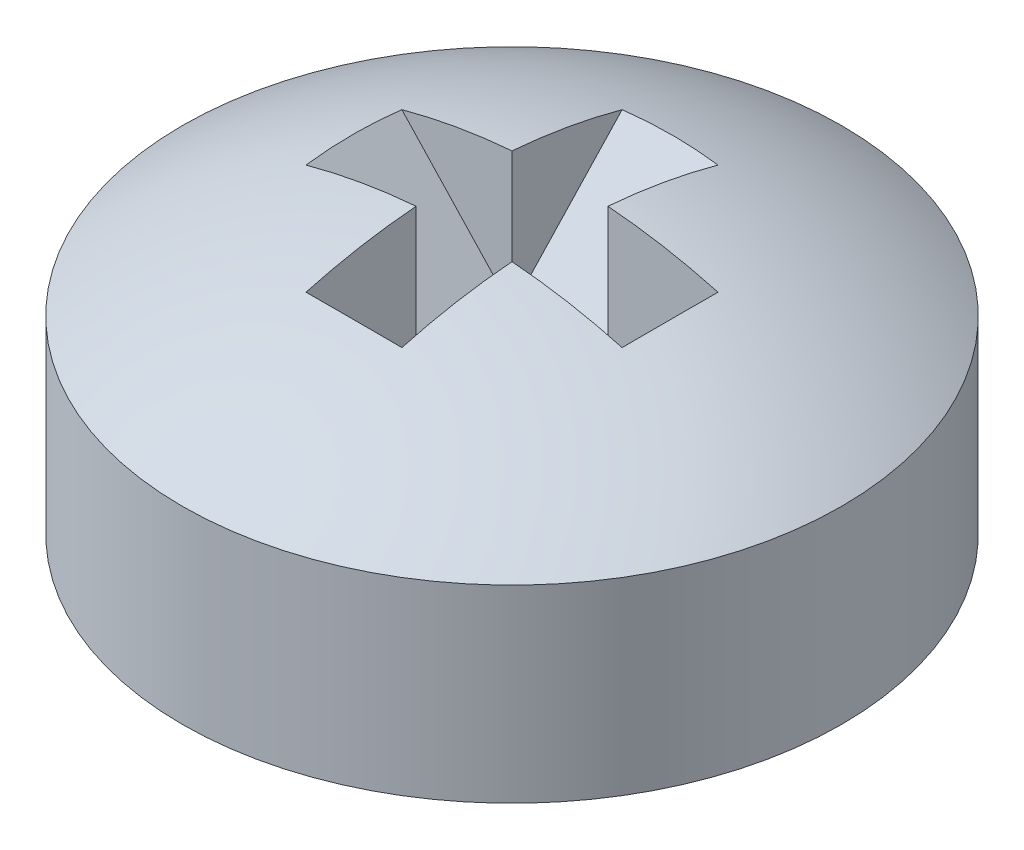
ISO-10303-21;
HEADER;
FILE_DESCRIPTION(('STEP AP214'),'2;1');
FILE_NAME('part.step','',(''),(''),'','','');
FILE_SCHEMA(('AUTOMOTIVE_DESIGN { 1 0 10303 214 1 1 1 1 }'));
ENDSEC;
DATA;
#1=APPLICATION_CONTEXT('core data for automotive mechanical design processes');
#2=APPLICATION_PROTOCOL_DEFINITION('international standard','automotive_design',2000,#1);
#3=PRODUCT_CONTEXT('',#1,'mechanical');
#4=PRODUCT('Part','Part','',(#3));
#5=PRODUCT_RELATED_PRODUCT_CATEGORY('part','',(#4));
#6=PRODUCT_DEFINITION_FORMATION('','',#4);
#7=PRODUCT_DEFINITION_CONTEXT('part definition',#1,'design');
#8=PRODUCT_DEFINITION('design','',#6,#7);
#9=PRODUCT_DEFINITION_SHAPE('','',#8);
#10=(LENGTH_UNIT() NAMED_UNIT(*) SI_UNIT(.MILLI.,.METRE.));
#11=(NAMED_UNIT(*) PLANE_ANGLE_UNIT() SI_UNIT($,.RADIAN.));
#12=(NAMED_UNIT(*) SI_UNIT($,.STERADIAN.) SOLID_ANGLE_UNIT());
#13=UNCERTAINTY_MEASURE_WITH_UNIT(LENGTH_MEASURE(1.E-05),#10,'distance_accuracy_value','');
#14=(GEOMETRIC_REPRESENTATION_CONTEXT(3) GLOBAL_UNCERTAINTY_ASSIGNED_CONTEXT((#13)) GLOBAL_UNIT_ASSIGNED_CONTEXT((#10,
#11,#12)) REPRESENTATION_CONTEXT('',''));
#15=CARTESIAN_POINT('',(0.,0.,0.));
#16=DIRECTION('',(0.,0.,1.));
#17=DIRECTION('',(1.,0.,0.));
#18=AXIS2_PLACEMENT_3D('',#15,#16,#17);
#19=CARTESIAN_POINT('',(0.,2.4,1.5));
#20=DIRECTION('',(0.,-0.68394112888133,0.729537204140085));
#21=DIRECTION('',(0.,-0.729537204140085,-0.68394112888133));
#22=AXIS2_PLACEMENT_3D('',#19,#20,#21);
#23=PLANE('',#22);
#24=DIRECTION('',(1.,0.,0.));
#25=VECTOR('',#24,1.);
#26=CARTESIAN_POINT('',(0.,0.8,0.));
#27=LINE('',#26,#25);
#28=CARTESIAN_POINT('',(0.,0.8,0.));
#29=VERTEX_POINT('',#28);
#30=CARTESIAN_POINT('',(-0.4,0.8,0.));
#31=VERTEX_POINT('',#30);
#32=EDGE_CURVE('E104',#29,#31,#27,.F.);
#33=ORIENTED_EDGE('',*,*,#32,.T.);
#34=DIRECTION('',(0.,-0.729537204140085,-0.68394112888133));
#35=VECTOR('',#34,1.);
#36=CARTESIAN_POINT('',(-0.4,1.22666666666667,0.4));
#37=LINE('',#36,#35);
#38=CARTESIAN_POINT('',(-0.4,1.22666666666667,0.4));
#39=VERTEX_POINT('',#38);
#40=EDGE_CURVE('E141',#39,#31,#37,.T.);
#41=ORIENTED_EDGE('',*,*,#40,.F.);
#42=DIRECTION('',(0.564532447121236,-0.602167943595985,-0.564532447121237));
#43=VECTOR('',#42,1.);
#44=CARTESIAN_POINT('',(-0.399999999999999,1.22666666666667,0.4));
#45=LINE('',#44,#43);
#46=EDGE_CURVE('E146',#39,#29,#45,.T.);
#47=ORIENTED_EDGE('',*,*,#46,.T.);
#48=EDGE_LOOP('',(#33,#41,#47));
#49=FACE_BOUND('',#48,.T.);
#50=ADVANCED_FACE('F17',(#49),#23,.F.);
#51=CARTESIAN_POINT('',(0.,0.8,0.));
#52=DIRECTION('',(0.,-0.68394112888133,-0.729537204140085));
#53=DIRECTION('',(0.,0.729537204140085,-0.68394112888133));
#54=AXIS2_PLACEMENT_3D('',#51,#52,#53);
#55=PLANE('',#54);
#56=DIRECTION('',(0.,0.729537204140085,-0.683941128881329));
#57=VECTOR('',#56,1.);
#58=CARTESIAN_POINT('',(-0.4,0.8,0.));
#59=LINE('',#58,#57);
#60=CARTESIAN_POINT('',(-0.4,1.22666666666667,-0.4));
#61=VERTEX_POINT('',#60);
#62=EDGE_CURVE('E112',#31,#61,#59,.T.);
#63=ORIENTED_EDGE('',*,*,#62,.F.);
#64=ORIENTED_EDGE('',*,*,#32,.F.);
#65=DIRECTION('',(-0.564532447121236,0.602167943595985,-0.564532447121236));
#66=VECTOR('',#65,1.);
#67=CARTESIAN_POINT('',(0.,0.8,0.));
#68=LINE('',#67,#66);
#69=EDGE_CURVE('E109',#29,#61,#68,.T.);
#70=ORIENTED_EDGE('',*,*,#69,.T.);
#71=EDGE_LOOP('',(#63,#64,#70));
#72=FACE_BOUND('',#71,.T.);
#73=ADVANCED_FACE('F108',(#72),#55,.F.);
#74=CARTESIAN_POINT('',(-1.5,2.4,0.));
#75=DIRECTION('',(-0.729537204140085,-0.68394112888133,0.));
#76=DIRECTION('',(0.68394112888133,-0.729537204140085,0.));
#77=AXIS2_PLACEMENT_3D('',#74,#75,#76);
#78=PLANE('',#77);
#79=DIRECTION('',(0.,0.,1.));
#80=VECTOR('',#79,1.);
#81=CARTESIAN_POINT('',(0.,0.8,0.));
#82=LINE('',#81,#80);
#83=CARTESIAN_POINT('',(0.,0.8,-0.4));
#84=VERTEX_POINT('',#83);
#85=EDGE_CURVE('E118',#29,#84,#82,.F.);
#86=ORIENTED_EDGE('',*,*,#85,.T.);
#87=DIRECTION('',(0.683941128881329,-0.729537204140085,0.));
#88=VECTOR('',#87,1.);
#89=CARTESIAN_POINT('',(-0.4,1.22666666666667,-0.4));
#90=LINE('',#89,#88);
#91=EDGE_CURVE('E121',#61,#84,#90,.T.);
#92=ORIENTED_EDGE('',*,*,#91,.F.);
#93=ORIENTED_EDGE('',*,*,#69,.F.);
#94=EDGE_LOOP('',(#86,#92,#93));
#95=FACE_BOUND('',#94,.T.);
#96=ADVANCED_FACE('F116',(#95),#78,.F.);
#97=CARTESIAN_POINT('',(0.,0.8,0.));
#98=DIRECTION('',(0.729537204140085,-0.68394112888133,0.));
#99=DIRECTION('',(0.68394112888133,0.729537204140085,0.));
#100=AXIS2_PLACEMENT_3D('',#97,#98,#99);
#101=PLANE('',#100);
#102=DIRECTION('',(0.68394112888133,0.729537204140085,0.));
#103=VECTOR('',#102,1.);
#104=CARTESIAN_POINT('',(0.,0.8,-0.4));
#105=LINE('',#104,#103);
#106=CARTESIAN_POINT('',(0.4,1.22666666666667,-0.4));
#107=VERTEX_POINT('',#106);
#108=EDGE_CURVE('E155',#84,#107,#105,.T.);
#109=ORIENTED_EDGE('',*,*,#108,.F.);
#110=ORIENTED_EDGE('',*,*,#85,.F.);
#111=DIRECTION('',(0.564532447121236,0.602167943595985,-0.564532447121236));
#112=VECTOR('',#111,1.);
#113=CARTESIAN_POINT('',(0.,0.8,0.));
#114=LINE('',#113,#112);
#115=EDGE_CURVE('E132',#29,#107,#114,.T.);
#116=ORIENTED_EDGE('',*,*,#115,.T.);
#117=EDGE_LOOP('',(#109,#110,#116));
#118=FACE_BOUND('',#117,.T.);
#119=ADVANCED_FACE('F153',(#118),#101,.F.);
#120=CARTESIAN_POINT('',(0.,2.4,1.5));
#121=DIRECTION('',(0.,-0.68394112888133,0.729537204140085));
#122=DIRECTION('',(0.,-0.729537204140085,-0.68394112888133));
#123=AXIS2_PLACEMENT_3D('',#120,#121,#122);
#124=PLANE('',#123);
#125=DIRECTION('',(0.,-0.729537204140085,-0.68394112888133));
#126=VECTOR('',#125,1.);
#127=CARTESIAN_POINT('',(0.4,1.22666666666667,0.400000000000001));
#128=LINE('',#127,#126);
#129=CARTESIAN_POINT('',(0.4,1.22666666666667,0.4));
#130=VERTEX_POINT('',#129);
#131=CARTESIAN_POINT('',(0.4,0.8,0.));
#132=VERTEX_POINT('',#131);
#133=EDGE_CURVE('E127',#130,#132,#128,.T.);
#134=ORIENTED_EDGE('',*,*,#133,.T.);
#135=DIRECTION('',(1.,0.,0.));
#136=VECTOR('',#135,1.);
#137=CARTESIAN_POINT('',(0.,0.8,0.));
#138=LINE('',#137,#136);
#139=EDGE_CURVE('E124',#132,#29,#138,.F.);
#140=ORIENTED_EDGE('',*,*,#139,.T.);
#141=DIRECTION('',(0.564532447121236,0.602167943595985,0.564532447121237));
#142=VECTOR('',#141,1.);
#143=CARTESIAN_POINT('',(0.,0.8,0.));
#144=LINE('',#143,#142);
#145=EDGE_CURVE('E81',#29,#130,#144,.T.);
#146=ORIENTED_EDGE('',*,*,#145,.T.);
#147=EDGE_LOOP('',(#134,#140,#146));
#148=FACE_BOUND('',#147,.T.);
#149=ADVANCED_FACE('F125',(#148),#124,.F.);
#150=CARTESIAN_POINT('',(0.,0.8,0.));
#151=DIRECTION('',(0.,-0.68394112888133,-0.729537204140085));
#152=DIRECTION('',(0.,0.729537204140085,-0.68394112888133));
#153=AXIS2_PLACEMENT_3D('',#150,#151,#152);
#154=PLANE('',#153);
#155=ORIENTED_EDGE('',*,*,#139,.F.);
#156=DIRECTION('',(0.,0.729537204140085,-0.683941128881329));
#157=VECTOR('',#156,1.);
#158=CARTESIAN_POINT('',(0.4,0.8,0.));
#159=LINE('',#158,#157);
#160=EDGE_CURVE('E158',#132,#107,#159,.T.);
#161=ORIENTED_EDGE('',*,*,#160,.T.);
#162=ORIENTED_EDGE('',*,*,#115,.F.);
#163=EDGE_LOOP('',(#155,#161,#162));
#164=FACE_BOUND('',#163,.T.);
#165=ADVANCED_FACE('F157',(#164),#154,.F.);
#166=CARTESIAN_POINT('',(-1.5,2.4,0.));
#167=DIRECTION('',(-0.729537204140085,-0.68394112888133,0.));
#168=DIRECTION('',(0.68394112888133,-0.729537204140085,0.));
#169=AXIS2_PLACEMENT_3D('',#166,#167,#168);
#170=PLANE('',#169);
#171=DIRECTION('',(0.683941128881331,-0.729537204140084,0.));
#172=VECTOR('',#171,1.);
#173=CARTESIAN_POINT('',(-0.4,1.22666666666667,0.4));
#174=LINE('',#173,#172);
#175=CARTESIAN_POINT('',(0.,0.8,0.4));
#176=VERTEX_POINT('',#175);
#177=EDGE_CURVE('E149',#39,#176,#174,.T.);
#178=ORIENTED_EDGE('',*,*,#177,.T.);
#179=DIRECTION('',(0.,0.,1.));
#180=VECTOR('',#179,1.);
#181=CARTESIAN_POINT('',(0.,0.8,0.));
#182=LINE('',#181,#180);
#183=EDGE_CURVE('E138',#176,#29,#182,.F.);
#184=ORIENTED_EDGE('',*,*,#183,.T.);
#185=ORIENTED_EDGE('',*,*,#46,.F.);
#186=EDGE_LOOP('',(#178,#184,#185));
#187=FACE_BOUND('',#186,.T.);
#188=ADVANCED_FACE('F145',(#187),#170,.F.);
#189=CARTESIAN_POINT('',(0.,0.8,0.));
#190=DIRECTION('',(0.729537204140085,-0.68394112888133,0.));
#191=DIRECTION('',(0.68394112888133,0.729537204140085,0.));
#192=AXIS2_PLACEMENT_3D('',#189,#190,#191);
#193=PLANE('',#192);
#194=ORIENTED_EDGE('',*,*,#183,.F.);
#195=DIRECTION('',(0.68394112888133,0.729537204140085,0.));
#196=VECTOR('',#195,1.);
#197=CARTESIAN_POINT('',(0.,0.8,0.4));
#198=LINE('',#197,#196);
#199=EDGE_CURVE('E140',#176,#130,#198,.T.);
#200=ORIENTED_EDGE('',*,*,#199,.T.);
#201=ORIENTED_EDGE('',*,*,#145,.F.);
#202=EDGE_LOOP('',(#194,#200,#201));
#203=FACE_BOUND('',#202,.T.);
#204=ADVANCED_FACE('F137',(#203),#193,.F.);
#205=CARTESIAN_POINT('',(-0.4,1.92492400934975,0.));
#206=DIRECTION('',(1.,0.,0.));
#207=DIRECTION('',(0.,0.,-1.));
#208=AXIS2_PLACEMENT_3D('',#205,#206,#207);
#209=PLANE('',#208);
#210=ORIENTED_EDGE('',*,*,#40,.T.);
#211=ORIENTED_EDGE('',*,*,#62,.T.);
#212=DIRECTION('',(0.,0.,1.));
#213=VECTOR('',#212,1.);
#214=CARTESIAN_POINT('',(-0.4,1.22666666666667,0.));
#215=LINE('',#214,#213);
#216=EDGE_CURVE('E244',#61,#39,#215,.T.);
#217=ORIENTED_EDGE('',*,*,#216,.T.);
#218=EDGE_LOOP('',(#210,#211,#217));
#219=FACE_BOUND('',#218,.T.);
#220=ADVANCED_FACE('F299',(#219),#209,.T.);
#221=CARTESIAN_POINT('',(0.,1.92492400934975,-0.4));
#222=DIRECTION('',(0.,0.,1.));
#223=DIRECTION('',(1.,0.,0.));
#224=AXIS2_PLACEMENT_3D('',#221,#222,#223);
#225=PLANE('',#224);
#226=ORIENTED_EDGE('',*,*,#91,.T.);
#227=ORIENTED_EDGE('',*,*,#108,.T.);
#228=DIRECTION('',(1.,0.,0.));
#229=VECTOR('',#228,1.);
#230=CARTESIAN_POINT('',(0.,1.22666666666667,-0.4));
#231=LINE('',#230,#229);
#232=EDGE_CURVE('E229',#107,#61,#231,.F.);
#233=ORIENTED_EDGE('',*,*,#232,.T.);
#234=EDGE_LOOP('',(#226,#227,#233));
#235=FACE_BOUND('',#234,.T.);
#236=ADVANCED_FACE('F406',(#235),#225,.T.);
#237=CARTESIAN_POINT('',(0.4,1.92492400934975,0.));
#238=DIRECTION('',(1.,0.,0.));
#239=DIRECTION('',(0.,0.,-1.));
#240=AXIS2_PLACEMENT_3D('',#237,#238,#239);
#241=PLANE('',#240);
#242=ORIENTED_EDGE('',*,*,#160,.F.);
#243=ORIENTED_EDGE('',*,*,#133,.F.);
#244=DIRECTION('',(0.,0.,1.));
#245=VECTOR('',#244,1.);
#246=CARTESIAN_POINT('',(0.4,1.22666666666667,0.));
#247=LINE('',#246,#245);
#248=EDGE_CURVE('E215',#130,#107,#247,.F.);
#249=ORIENTED_EDGE('',*,*,#248,.T.);
#250=EDGE_LOOP('',(#242,#243,#249));
#251=FACE_BOUND('',#250,.T.);
#252=ADVANCED_FACE('F402',(#251),#241,.F.);
#253=CARTESIAN_POINT('',(0.,1.92492400934975,0.4));
#254=DIRECTION('',(0.,0.,1.));
#255=DIRECTION('',(1.,0.,0.));
#256=AXIS2_PLACEMENT_3D('',#253,#254,#255);
#257=PLANE('',#256);
#258=ORIENTED_EDGE('',*,*,#199,.F.);
#259=ORIENTED_EDGE('',*,*,#177,.F.);
#260=DIRECTION('',(1.,0.,0.));
#261=VECTOR('',#260,1.);
#262=CARTESIAN_POINT('',(0.,1.22666666666667,0.399999999999999));
#263=LINE('',#262,#261);
#264=EDGE_CURVE('E202',#39,#130,#263,.T.);
#265=ORIENTED_EDGE('',*,*,#264,.T.);
#266=EDGE_LOOP('',(#258,#259,#265));
#267=FACE_BOUND('',#266,.T.);
#268=ADVANCED_FACE('F399',(#267),#257,.F.);
#269=CARTESIAN_POINT('',(-0.4,1.92492400934975,0.));
#270=DIRECTION('',(1.,0.,0.));
#271=DIRECTION('',(0.,0.,-1.));
#272=AXIS2_PLACEMENT_3D('',#269,#270,#271);
#273=PLANE('',#272);
#274=DIRECTION('',(0.,-0.729537204140085,-0.68394112888133));
#275=VECTOR('',#274,1.);
#276=CARTESIAN_POINT('',(-0.4,2.4,1.5));
#277=LINE('',#276,#275);
#278=CARTESIAN_POINT('',(-0.4,2.20640635415834,1.31850595702345));
#279=VERTEX_POINT('',#278);
#280=EDGE_CURVE('E205',#279,#39,#277,.T.);
#281=ORIENTED_EDGE('',*,*,#280,.T.);
#282=DIRECTION('',(0.,1.,0.));
#283=VECTOR('',#282,1.);
#284=CARTESIAN_POINT('',(-0.4,1.92492400934975,0.4));
#285=LINE('',#284,#283);
#286=CARTESIAN_POINT('',(-0.4,2.36789693934969,0.4));
#287=VERTEX_POINT('',#286);
#288=EDGE_CURVE('E249',#39,#287,#285,.T.);
#289=ORIENTED_EDGE('',*,*,#288,.T.);
#290=CARTESIAN_POINT('',(-0.4,-2.6,0.));
#291=DIRECTION('',(1.,0.,0.));
#292=DIRECTION('',(0.,0.,-1.));
#293=AXIS2_PLACEMENT_3D('',#290,#291,#292);
#294=CIRCLE('',#293,4.98397431775085);
#295=EDGE_CURVE('E20',#279,#287,#294,.F.);
#296=ORIENTED_EDGE('',*,*,#295,.F.);
#297=EDGE_LOOP('',(#281,#289,#296));
#298=FACE_BOUND('',#297,.T.);
#299=ADVANCED_FACE('F313',(#298),#273,.T.);
#300=CARTESIAN_POINT('',(0.,1.92492400934975,0.4));
#301=DIRECTION('',(0.,0.,1.));
#302=DIRECTION('',(1.,0.,0.));
#303=AXIS2_PLACEMENT_3D('',#300,#301,#302);
#304=PLANE('',#303);
#305=DIRECTION('',(0.68394112888133,-0.729537204140085,0.));
#306=VECTOR('',#305,1.);
#307=CARTESIAN_POINT('',(-1.5,2.4,0.4));
#308=LINE('',#307,#306);
#309=CARTESIAN_POINT('',(-1.31850595702345,2.20640635415834,0.4));
#310=VERTEX_POINT('',#309);
#311=EDGE_CURVE('E247',#39,#310,#308,.F.);
#312=ORIENTED_EDGE('',*,*,#311,.T.);
#313=CARTESIAN_POINT('',(-0.4,2.36789693934969,0.4));
#314=CARTESIAN_POINT('',(-0.555608019087827,2.3553357868199,0.4));
#315=CARTESIAN_POINT('',(-0.709954191717028,2.33559766178907,0.4));
#316=CARTESIAN_POINT('',(-1.01612284405818,2.28176746672528,0.4));
#317=CARTESIAN_POINT('',(-1.16794532377013,2.24767539669234,0.4));
#318=CARTESIAN_POINT('',(-1.31850595702345,2.20640635415834,0.4));
#319=B_SPLINE_CURVE_WITH_KNOTS('',3,(#313,#314,#315,#316,#317,#318),.UNSPECIFIED.,.F.,.F.,(4,2,
4),(0.,0.466809395005226,0.933618790010451),.UNSPECIFIED.);
#320=EDGE_CURVE('E312',#287,#310,#319,.T.);
#321=ORIENTED_EDGE('',*,*,#320,.F.);
#322=ORIENTED_EDGE('',*,*,#288,.F.);
#323=EDGE_LOOP('',(#312,#321,#322));
#324=FACE_BOUND('',#323,.T.);
#325=ADVANCED_FACE('F311',(#324),#304,.F.);
#326=CARTESIAN_POINT('',(-1.5,2.4,0.));
#327=DIRECTION('',(-0.729537204140085,-0.68394112888133,0.));
#328=DIRECTION('',(0.68394112888133,-0.729537204140085,0.));
#329=AXIS2_PLACEMENT_3D('',#326,#327,#328);
#330=PLANE('',#329);
#331=DIRECTION('',(0.68394112888133,-0.729537204140084,0.));
#332=VECTOR('',#331,1.);
#333=CARTESIAN_POINT('',(-1.31850595702345,2.20640635415834,-0.4));
#334=LINE('',#333,#332);
#335=CARTESIAN_POINT('',(-1.31850595702345,2.20640635415834,-0.399999999999999));
#336=VERTEX_POINT('',#335);
#337=EDGE_CURVE('E239',#336,#61,#334,.T.);
#338=ORIENTED_EDGE('',*,*,#337,.F.);
#339=CARTESIAN_POINT('',(-1.31850595702345,2.20640635415834,0.4));
#340=CARTESIAN_POINT('',(-1.3267637070077,2.21521462080821,0.266666666666666));
#341=CARTESIAN_POINT('',(-1.33089258199982,2.21961875413315,0.133333333333332));
#342=CARTESIAN_POINT('',(-1.33089258199982,2.21961875413315,-0.133333333333335));
#343=CARTESIAN_POINT('',(-1.3267637070077,2.21521462080821,-0.266666666666669));
#344=CARTESIAN_POINT('',(-1.31850595702344,2.20640635415834,-0.400000000000003));
#345=B_SPLINE_CURVE_WITH_KNOTS('',3,(#339,#340,#341,#342,#343,#344),.UNSPECIFIED.,.F.,.F.,(4,2,
4),(0.,0.400409785084481,0.800819570168963),.UNSPECIFIED.);
#346=EDGE_CURVE('E306',#310,#336,#345,.T.);
#347=ORIENTED_EDGE('',*,*,#346,.F.);
#348=ORIENTED_EDGE('',*,*,#311,.F.);
#349=ORIENTED_EDGE('',*,*,#216,.F.);
#350=EDGE_LOOP('',(#338,#347,#348,#349));
#351=FACE_BOUND('',#350,.T.);
#352=ADVANCED_FACE('F304',(#351),#330,.F.);
#353=CARTESIAN_POINT('',(0.,1.92492400934975,-0.4));
#354=DIRECTION('',(0.,0.,1.));
#355=DIRECTION('',(1.,0.,0.));
#356=AXIS2_PLACEMENT_3D('',#353,#354,#355);
#357=PLANE('',#356);
#358=CARTESIAN_POINT('',(-1.31850595702345,2.20640635415834,-0.399999999999997));
#359=CARTESIAN_POINT('',(-1.16794532377014,2.24767539669233,-0.400000000000005));
#360=CARTESIAN_POINT('',(-1.01612284405821,2.28176746672527,-0.400000000000006));
#361=CARTESIAN_POINT('',(-0.709954191717088,2.33559766178906,-0.399999999999994));
#362=CARTESIAN_POINT('',(-0.555608019087902,2.35533578681989,-0.399999999999981));
#363=CARTESIAN_POINT('',(-0.400000000000091,2.36789693934968,-0.39999999999996));
#364=B_SPLINE_CURVE_WITH_KNOTS('',3,(#358,#359,#360,#361,#362,#363),.UNSPECIFIED.,.F.,.F.,(4,2,
4),(0.,0.46680939500518,0.93361879001036),.UNSPECIFIED.);
#365=CARTESIAN_POINT('',(-0.4,2.36789693934969,-0.4));
#366=VERTEX_POINT('',#365);
#367=EDGE_CURVE('E382',#336,#366,#364,.T.);
#368=ORIENTED_EDGE('',*,*,#367,.F.);
#369=ORIENTED_EDGE('',*,*,#337,.T.);
#370=DIRECTION('',(0.,1.,0.));
#371=VECTOR('',#370,1.);
#372=CARTESIAN_POINT('',(-0.4,1.92492400934975,-0.4));
#373=LINE('',#372,#371);
#374=EDGE_CURVE('E234',#366,#61,#373,.F.);
#375=ORIENTED_EDGE('',*,*,#374,.F.);
#376=EDGE_LOOP('',(#368,#369,#375));
#377=FACE_BOUND('',#376,.T.);
#378=ADVANCED_FACE('F374',(#377),#357,.T.);
#379=CARTESIAN_POINT('',(-0.4,1.92492400934975,0.));
#380=DIRECTION('',(1.,0.,0.));
#381=DIRECTION('',(0.,0.,-1.));
#382=AXIS2_PLACEMENT_3D('',#379,#380,#381);
#383=PLANE('',#382);
#384=DIRECTION('',(0.,0.729537204140085,-0.68394112888133));
#385=VECTOR('',#384,1.);
#386=CARTESIAN_POINT('',(-0.4,0.8,0.));
#387=LINE('',#386,#385);
#388=CARTESIAN_POINT('',(-0.4,2.20640635415834,-1.31850595702345));
#389=VERTEX_POINT('',#388);
#390=EDGE_CURVE('E232',#61,#389,#387,.T.);
#391=ORIENTED_EDGE('',*,*,#390,.T.);
#392=CARTESIAN_POINT('',(-0.4,-2.6,0.));
#393=DIRECTION('',(1.,0.,0.));
#394=DIRECTION('',(0.,0.,-1.));
#395=AXIS2_PLACEMENT_3D('',#392,#393,#394);
#396=CIRCLE('',#395,4.98397431775085);
#397=EDGE_CURVE('E364',#366,#389,#396,.F.);
#398=ORIENTED_EDGE('',*,*,#397,.F.);
#399=ORIENTED_EDGE('',*,*,#374,.T.);
#400=EDGE_LOOP('',(#391,#398,#399));
#401=FACE_BOUND('',#400,.T.);
#402=ADVANCED_FACE('F370',(#401),#383,.T.);
#403=CARTESIAN_POINT('',(0.,0.8,0.));
#404=DIRECTION('',(0.,-0.68394112888133,-0.729537204140085));
#405=DIRECTION('',(0.,0.729537204140085,-0.68394112888133));
#406=AXIS2_PLACEMENT_3D('',#403,#404,#405);
#407=PLANE('',#406);
#408=DIRECTION('',(0.,0.729537204140085,-0.68394112888133));
#409=VECTOR('',#408,1.);
#410=CARTESIAN_POINT('',(0.4,1.22666666666667,-0.4));
#411=LINE('',#410,#409);
#412=CARTESIAN_POINT('',(0.399999999999999,2.20640635415834,-1.31850595702345));
#413=VERTEX_POINT('',#412);
#414=EDGE_CURVE('E225',#107,#413,#411,.T.);
#415=ORIENTED_EDGE('',*,*,#414,.T.);
#416=CARTESIAN_POINT('',(-0.4,2.20640635415834,-1.31850595702345));
#417=CARTESIAN_POINT('',(-0.266666666666667,2.21521462080821,-1.3267637070077));
#418=CARTESIAN_POINT('',(-0.133333333333333,2.21961875413315,-1.33089258199983));
#419=CARTESIAN_POINT('',(0.133333333333333,2.21961875413315,-1.33089258199983));
#420=CARTESIAN_POINT('',(0.266666666666666,2.21521462080821,-1.3267637070077));
#421=CARTESIAN_POINT('',(0.399999999999999,2.20640635415834,-1.31850595702345));
#422=B_SPLINE_CURVE_WITH_KNOTS('',3,(#416,#417,#418,#419,#420,#421),.UNSPECIFIED.,.F.,.F.,(4,2,
4),(0.,0.40040978508448,0.80081957016896),.UNSPECIFIED.);
#423=EDGE_CURVE('E358',#389,#413,#422,.T.);
#424=ORIENTED_EDGE('',*,*,#423,.F.);
#425=ORIENTED_EDGE('',*,*,#390,.F.);
#426=ORIENTED_EDGE('',*,*,#232,.F.);
#427=EDGE_LOOP('',(#415,#424,#425,#426));
#428=FACE_BOUND('',#427,.T.);
#429=ADVANCED_FACE('F366',(#428),#407,.F.);
#430=CARTESIAN_POINT('',(0.4,1.92492400934975,0.));
#431=DIRECTION('',(1.,0.,0.));
#432=DIRECTION('',(0.,0.,-1.));
#433=AXIS2_PLACEMENT_3D('',#430,#431,#432);
#434=PLANE('',#433);
#435=ORIENTED_EDGE('',*,*,#414,.F.);
#436=DIRECTION('',(0.,1.,0.));
#437=VECTOR('',#436,1.);
#438=CARTESIAN_POINT('',(0.4,1.92492400934975,-0.4));
#439=LINE('',#438,#437);
#440=CARTESIAN_POINT('',(0.399999999999999,2.36789693934969,-0.4));
#441=VERTEX_POINT('',#440);
#442=EDGE_CURVE('E220',#441,#107,#439,.F.);
#443=ORIENTED_EDGE('',*,*,#442,.F.);
#444=CARTESIAN_POINT('',(0.399999999999999,-2.6,0.));
#445=DIRECTION('',(1.,0.,0.));
#446=DIRECTION('',(0.,0.,-1.));
#447=AXIS2_PLACEMENT_3D('',#444,#445,#446);
#448=CIRCLE('',#447,4.98397431775085);
#449=EDGE_CURVE('E355',#413,#441,#448,.T.);
#450=ORIENTED_EDGE('',*,*,#449,.F.);
#451=EDGE_LOOP('',(#435,#443,#450));
#452=FACE_BOUND('',#451,.T.);
#453=ADVANCED_FACE('F347',(#452),#434,.F.);
#454=CARTESIAN_POINT('',(0.,1.92492400934975,-0.4));
#455=DIRECTION('',(0.,0.,1.));
#456=DIRECTION('',(1.,0.,0.));
#457=AXIS2_PLACEMENT_3D('',#454,#455,#456);
#458=PLANE('',#457);
#459=DIRECTION('',(0.68394112888133,0.729537204140085,0.));
#460=VECTOR('',#459,1.);
#461=CARTESIAN_POINT('',(0.,0.8,-0.4));
#462=LINE('',#461,#460);
#463=CARTESIAN_POINT('',(1.31850595702345,2.20640635415834,-0.400000000000001));
#464=VERTEX_POINT('',#463);
#465=EDGE_CURVE('E218',#107,#464,#462,.T.);
#466=ORIENTED_EDGE('',*,*,#465,.T.);
#467=CARTESIAN_POINT('',(0.399999999999999,2.36789693934969,-0.400000000000001));
#468=CARTESIAN_POINT('',(0.555608019087826,2.3553357868199,-0.400000000000001));
#469=CARTESIAN_POINT('',(0.709954191717027,2.33559766178906,-0.4));
#470=CARTESIAN_POINT('',(1.01612284405818,2.28176746672528,-0.4));
#471=CARTESIAN_POINT('',(1.16794532377012,2.24767539669234,-0.399999999999999));
#472=CARTESIAN_POINT('',(1.31850595702345,2.20640635415834,-0.399999999999998));
#473=B_SPLINE_CURVE_WITH_KNOTS('',3,(#467,#468,#469,#470,#471,#472),.UNSPECIFIED.,.F.,.F.,(4,2,
4),(0.,0.466809395005225,0.93361879001045),.UNSPECIFIED.);
#474=EDGE_CURVE('E322',#441,#464,#473,.T.);
#475=ORIENTED_EDGE('',*,*,#474,.F.);
#476=ORIENTED_EDGE('',*,*,#442,.T.);
#477=EDGE_LOOP('',(#466,#475,#476));
#478=FACE_BOUND('',#477,.T.);
#479=ADVANCED_FACE('F342',(#478),#458,.T.);
#480=CARTESIAN_POINT('',(0.,0.8,0.));
#481=DIRECTION('',(0.729537204140085,-0.68394112888133,0.));
#482=DIRECTION('',(0.68394112888133,0.729537204140085,0.));
#483=AXIS2_PLACEMENT_3D('',#480,#481,#482);
#484=PLANE('',#483);
#485=DIRECTION('',(0.68394112888133,0.729537204140085,0.));
#486=VECTOR('',#485,1.);
#487=CARTESIAN_POINT('',(0.4,1.22666666666667,0.4));
#488=LINE('',#487,#486);
#489=CARTESIAN_POINT('',(1.31850595702345,2.20640635415834,0.4));
#490=VERTEX_POINT('',#489);
#491=EDGE_CURVE('E211',#130,#490,#488,.T.);
#492=ORIENTED_EDGE('',*,*,#491,.T.);
#493=CARTESIAN_POINT('',(1.31850595702345,2.20640635415834,-0.400000000000003));
#494=CARTESIAN_POINT('',(1.3267637070077,2.21521462080821,-0.266666666666668));
#495=CARTESIAN_POINT('',(1.33089258199982,2.21961875413315,-0.133333333333335));
#496=CARTESIAN_POINT('',(1.33089258199982,2.21961875413315,0.133333333333333));
#497=CARTESIAN_POINT('',(1.3267637070077,2.21521462080821,0.266666666666667));
#498=CARTESIAN_POINT('',(1.31850595702344,2.20640635415834,0.400000000000001));
#499=B_SPLINE_CURVE_WITH_KNOTS('',3,(#493,#494,#495,#496,#497,#498),.UNSPECIFIED.,.F.,.F.,(4,2,
4),(0.,0.400409785084482,0.800819570168964),.UNSPECIFIED.);
#500=EDGE_CURVE('E321',#464,#490,#499,.T.);
#501=ORIENTED_EDGE('',*,*,#500,.F.);
#502=ORIENTED_EDGE('',*,*,#465,.F.);
#503=ORIENTED_EDGE('',*,*,#248,.F.);
#504=EDGE_LOOP('',(#492,#501,#502,#503));
#505=FACE_BOUND('',#504,.T.);
#506=ADVANCED_FACE('F337',(#505),#484,.F.);
#507=CARTESIAN_POINT('',(0.,1.92492400934975,0.4));
#508=DIRECTION('',(0.,0.,1.));
#509=DIRECTION('',(1.,0.,0.));
#510=AXIS2_PLACEMENT_3D('',#507,#508,#509);
#511=PLANE('',#510);
#512=CARTESIAN_POINT('',(1.31850595702345,2.20640635415834,0.4));
#513=CARTESIAN_POINT('',(1.16794532377014,2.24767539669233,0.400000000000013));
#514=CARTESIAN_POINT('',(1.01612284405821,2.28176746672527,0.400000000000013));
#515=CARTESIAN_POINT('',(0.709954191717087,2.33559766178905,0.399999999999987));
#516=CARTESIAN_POINT('',(0.555608019087902,2.35533578681989,0.399999999999962));
#517=CARTESIAN_POINT('',(0.40000000000009,2.36789693934968,0.399999999999925));
#518=B_SPLINE_CURVE_WITH_KNOTS('',3,(#512,#513,#514,#515,#516,#517),.UNSPECIFIED.,.F.,.F.,(4,2,
4),(0.,0.46680939500518,0.93361879001036),.UNSPECIFIED.);
#519=CARTESIAN_POINT('',(0.399999999999999,2.36789693934969,0.400000000000001));
#520=VERTEX_POINT('',#519);
#521=EDGE_CURVE('E320',#490,#520,#518,.T.);
#522=ORIENTED_EDGE('',*,*,#521,.F.);
#523=ORIENTED_EDGE('',*,*,#491,.F.);
#524=DIRECTION('',(0.,1.,0.));
#525=VECTOR('',#524,1.);
#526=CARTESIAN_POINT('',(0.4,1.92492400934975,0.400000000000001));
#527=LINE('',#526,#525);
#528=EDGE_CURVE('E207',#130,#520,#527,.T.);
#529=ORIENTED_EDGE('',*,*,#528,.T.);
#530=EDGE_LOOP('',(#522,#523,#529));
#531=FACE_BOUND('',#530,.T.);
#532=ADVANCED_FACE('F333',(#531),#511,.F.);
#533=CARTESIAN_POINT('',(0.4,1.92492400934975,0.));
#534=DIRECTION('',(1.,0.,0.));
#535=DIRECTION('',(0.,0.,-1.));
#536=AXIS2_PLACEMENT_3D('',#533,#534,#535);
#537=PLANE('',#536);
#538=ORIENTED_EDGE('',*,*,#528,.F.);
#539=DIRECTION('',(0.,-0.729537204140085,-0.68394112888133));
#540=VECTOR('',#539,1.);
#541=CARTESIAN_POINT('',(0.4,2.4,1.5));
#542=LINE('',#541,#540);
#543=CARTESIAN_POINT('',(0.4,2.20640635415834,1.31850595702345));
#544=VERTEX_POINT('',#543);
#545=EDGE_CURVE('E35',#130,#544,#542,.F.);
#546=ORIENTED_EDGE('',*,*,#545,.T.);
#547=CARTESIAN_POINT('',(0.399999999999999,-2.6,0.));
#548=DIRECTION('',(1.,0.,0.));
#549=DIRECTION('',(0.,0.,-1.));
#550=AXIS2_PLACEMENT_3D('',#547,#548,#549);
#551=CIRCLE('',#550,4.98397431775085);
#552=EDGE_CURVE('E183',#520,#544,#551,.T.);
#553=ORIENTED_EDGE('',*,*,#552,.F.);
#554=EDGE_LOOP('',(#538,#546,#553));
#555=FACE_BOUND('',#554,.T.);
#556=ADVANCED_FACE('F336',(#555),#537,.F.);
#557=CARTESIAN_POINT('',(0.,2.4,1.5));
#558=DIRECTION('',(0.,-0.68394112888133,0.729537204140085));
#559=DIRECTION('',(0.,-0.729537204140085,-0.68394112888133));
#560=AXIS2_PLACEMENT_3D('',#557,#558,#559);
#561=PLANE('',#560);
#562=ORIENTED_EDGE('',*,*,#545,.F.);
#563=ORIENTED_EDGE('',*,*,#264,.F.);
#564=ORIENTED_EDGE('',*,*,#280,.F.);
#565=CARTESIAN_POINT('',(0.399999999999999,2.20640635415834,1.31850595702345));
#566=CARTESIAN_POINT('',(0.266666666666666,2.21521462080821,1.3267637070077));
#567=CARTESIAN_POINT('',(0.133333333333333,2.21961875413315,1.33089258199982));
#568=CARTESIAN_POINT('',(-0.133333333333333,2.21961875413315,1.33089258199982));
#569=CARTESIAN_POINT('',(-0.266666666666667,2.21521462080821,1.3267637070077));
#570=CARTESIAN_POINT('',(-0.4,2.20640635415834,1.31850595702345));
#571=B_SPLINE_CURVE_WITH_KNOTS('',3,(#565,#566,#567,#568,#569,#570),.UNSPECIFIED.,.F.,.F.,(4,2,
4),(0.,0.40040978508448,0.80081957016896),.UNSPECIFIED.);
#572=EDGE_CURVE('E175',#544,#279,#571,.T.);
#573=ORIENTED_EDGE('',*,*,#572,.F.);
#574=EDGE_LOOP('',(#562,#563,#564,#573));
#575=FACE_BOUND('',#574,.T.);
#576=ADVANCED_FACE('F185',(#575),#561,.F.);
#577=CARTESIAN_POINT('',(1.375,0.,0.));
#578=DIRECTION('',(0.,-1.,0.));
#579=DIRECTION('',(0.,0.,-1.));
#580=AXIS2_PLACEMENT_3D('',#577,#578,#579);
#581=PLANE('',#580);
#582=CARTESIAN_POINT('',(0.,0.,0.));
#583=DIRECTION('',(0.,-1.,0.));
#584=DIRECTION('',(1.,0.,0.));
#585=AXIS2_PLACEMENT_3D('',#582,#583,#584);
#586=CIRCLE('',#585,2.75);
#587=CARTESIAN_POINT('',(2.75,0.,0.));
#588=VERTEX_POINT('',#587);
#589=EDGE_CURVE('E26',#588,#588,#586,.F.);
#590=ORIENTED_EDGE('',*,*,#589,.F.);
#591=EDGE_LOOP('',(#590));
#592=FACE_BOUND('',#591,.T.);
#593=ADVANCED_FACE('F195',(#592),#581,.T.);
#594=CARTESIAN_POINT('',(0.,-2.6,0.));
#595=DIRECTION('',(1.,0.,0.));
#596=DIRECTION('',(0.,1.,0.));
#597=AXIS2_PLACEMENT_3D('',#594,#595,#596);
#598=SPHERICAL_SURFACE('',#597,5.);
#599=CARTESIAN_POINT('',(0.,1.57582327212252,0.));
#600=DIRECTION('',(0.,-1.,0.));
#601=DIRECTION('',(1.,0.,0.));
#602=AXIS2_PLACEMENT_3D('',#599,#600,#601);
#603=CIRCLE('',#602,2.75);
#604=CARTESIAN_POINT('',(2.75,1.57582327212252,0.));
#605=VERTEX_POINT('',#604);
#606=EDGE_CURVE('E11',#605,#605,#603,.T.);
#607=ORIENTED_EDGE('',*,*,#606,.F.);
#608=EDGE_LOOP('',(#607));
#609=FACE_BOUND('',#608,.T.);
#610=ORIENTED_EDGE('',*,*,#552,.T.);
#611=ORIENTED_EDGE('',*,*,#572,.T.);
#612=ORIENTED_EDGE('',*,*,#295,.T.);
#613=ORIENTED_EDGE('',*,*,#320,.T.);
#614=ORIENTED_EDGE('',*,*,#346,.T.);
#615=ORIENTED_EDGE('',*,*,#367,.T.);
#616=ORIENTED_EDGE('',*,*,#397,.T.);
#617=ORIENTED_EDGE('',*,*,#423,.T.);
#618=ORIENTED_EDGE('',*,*,#449,.T.);
#619=ORIENTED_EDGE('',*,*,#474,.T.);
#620=ORIENTED_EDGE('',*,*,#500,.T.);
#621=ORIENTED_EDGE('',*,*,#521,.T.);
#622=EDGE_LOOP('',(#610,#611,#612,#613,#614,#615,#616,#617,#618,#619,#620,#621));
#623=FACE_BOUND('',#622,.T.);
#624=ADVANCED_FACE('F189',(#609,#623),#598,.T.);
#625=CARTESIAN_POINT('',(0.,0.787911636061258,0.));
#626=DIRECTION('',(0.,-1.,0.));
#627=DIRECTION('',(1.,0.,0.));
#628=AXIS2_PLACEMENT_3D('',#625,#626,#627);
#629=CYLINDRICAL_SURFACE('',#628,2.75);
#630=ORIENTED_EDGE('',*,*,#606,.T.);
#631=EDGE_LOOP('',(#630));
#632=FACE_BOUND('',#631,.T.);
#633=ORIENTED_EDGE('',*,*,#589,.T.);
#634=EDGE_LOOP('',(#633));
#635=FACE_BOUND('',#634,.T.);
#636=ADVANCED_FACE('F194',(#632,#635),#629,.T.);
#637=CLOSED_SHELL('',(#50,#73,#96,#119,#149,#165,#188,#204,#220,#236,#252,#268,#299,#325,#352,
#378,#402,#429,#453,#479,#506,#532,#556,#576,#593,#624,#636));
#638=MANIFOLD_SOLID_BREP('B1',#637);
#639=ADVANCED_BREP_SHAPE_REPRESENTATION('',(#18,#638),#14);
#640=SHAPE_DEFINITION_REPRESENTATION(#9,#639);
ENDSEC;
END-ISO-10303-21;
